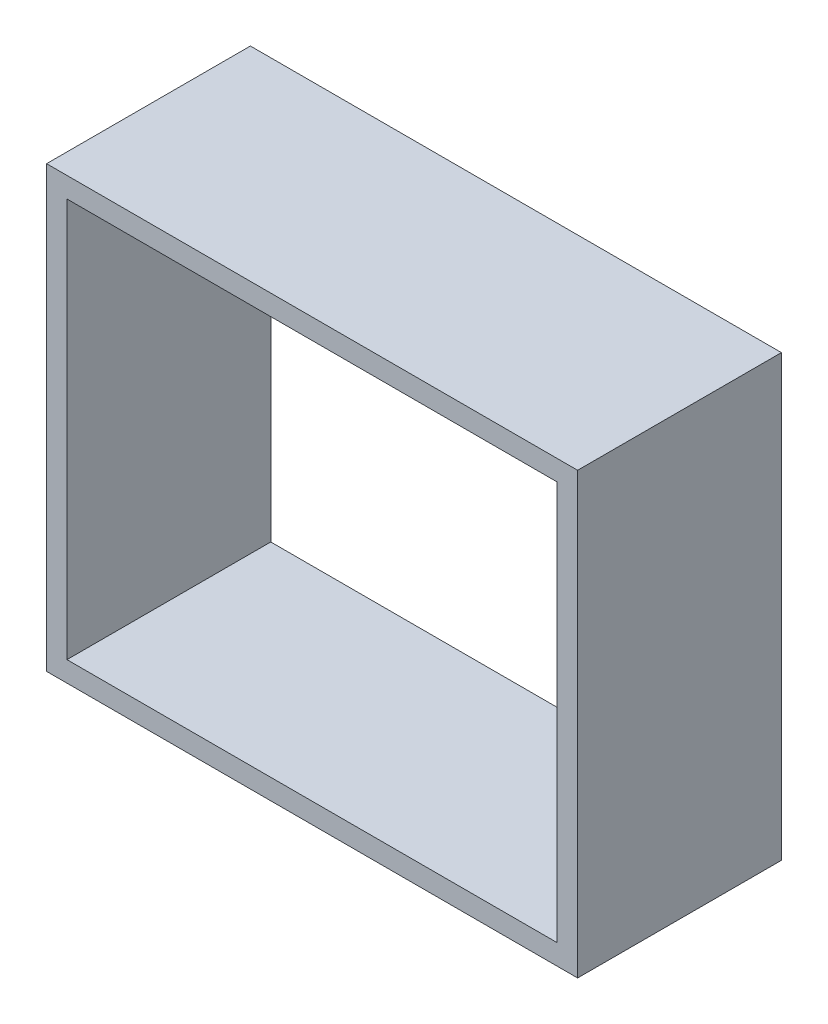
ISO-10303-21;
HEADER;
FILE_DESCRIPTION(('STEP AP214'),'2;1');
FILE_NAME('part.step','',(''),(''),'','','');
FILE_SCHEMA(('AUTOMOTIVE_DESIGN { 1 0 10303 214 1 1 1 1 }'));
ENDSEC;
DATA;
#1=APPLICATION_CONTEXT('core data for automotive mechanical design processes');
#2=APPLICATION_PROTOCOL_DEFINITION('international standard','automotive_design',2000,#1);
#3=PRODUCT_CONTEXT('',#1,'mechanical');
#4=PRODUCT('Part','Part','',(#3));
#5=PRODUCT_RELATED_PRODUCT_CATEGORY('part','',(#4));
#6=PRODUCT_DEFINITION_FORMATION('','',#4);
#7=PRODUCT_DEFINITION_CONTEXT('part definition',#1,'design');
#8=PRODUCT_DEFINITION('design','',#6,#7);
#9=PRODUCT_DEFINITION_SHAPE('','',#8);
#10=(LENGTH_UNIT() NAMED_UNIT(*) SI_UNIT(.MILLI.,.METRE.));
#11=(NAMED_UNIT(*) PLANE_ANGLE_UNIT() SI_UNIT($,.RADIAN.));
#12=(NAMED_UNIT(*) SI_UNIT($,.STERADIAN.) SOLID_ANGLE_UNIT());
#13=UNCERTAINTY_MEASURE_WITH_UNIT(LENGTH_MEASURE(1.E-05),#10,'distance_accuracy_value','');
#14=(GEOMETRIC_REPRESENTATION_CONTEXT(3) GLOBAL_UNCERTAINTY_ASSIGNED_CONTEXT((#13)) GLOBAL_UNIT_ASSIGNED_CONTEXT((#10,
#11,#12)) REPRESENTATION_CONTEXT('',''));
#15=CARTESIAN_POINT('',(0.,0.,0.));
#16=DIRECTION('',(0.,0.,1.));
#17=DIRECTION('',(1.,0.,0.));
#18=AXIS2_PLACEMENT_3D('',#15,#16,#17);
#19=CARTESIAN_POINT('',(0.,0.,50.));
#20=DIRECTION('',(0.,0.,1.));
#21=DIRECTION('',(1.,0.,0.));
#22=AXIS2_PLACEMENT_3D('',#19,#20,#21);
#23=PLANE('',#22);
#24=DIRECTION('',(0.,-1.,0.));
#25=VECTOR('',#24,1.);
#26=CARTESIAN_POINT('',(-32.7272727272732,70.5301378498123,50.));
#27=LINE('',#26,#25);
#28=CARTESIAN_POINT('',(-32.7272727272732,70.5301378498123,50.));
#29=VERTEX_POINT('',#28);
#30=CARTESIAN_POINT('',(-32.7272727272731,-37.3484848484853,50.));
#31=VERTEX_POINT('',#30);
#32=EDGE_CURVE('E134',#29,#31,#27,.T.);
#33=ORIENTED_EDGE('',*,*,#32,.T.);
#34=DIRECTION('',(1.,0.,0.));
#35=VECTOR('',#34,1.);
#36=CARTESIAN_POINT('',(-32.7272727272731,-37.3484848484853,50.));
#37=LINE('',#36,#35);
#38=CARTESIAN_POINT('',(97.5564292307329,-37.3484848484853,50.));
#39=VERTEX_POINT('',#38);
#40=EDGE_CURVE('E137',#31,#39,#37,.T.);
#41=ORIENTED_EDGE('',*,*,#40,.T.);
#42=DIRECTION('',(0.,1.,0.));
#43=VECTOR('',#42,1.);
#44=CARTESIAN_POINT('',(97.5564292307329,70.5301378498123,50.));
#45=LINE('',#44,#43);
#46=CARTESIAN_POINT('',(97.5564292307329,70.5301378498123,50.));
#47=VERTEX_POINT('',#46);
#48=EDGE_CURVE('E140',#39,#47,#45,.T.);
#49=ORIENTED_EDGE('',*,*,#48,.T.);
#50=DIRECTION('',(-1.,0.,0.));
#51=VECTOR('',#50,1.);
#52=CARTESIAN_POINT('',(-32.7272727272732,70.5301378498123,50.));
#53=LINE('',#52,#51);
#54=EDGE_CURVE('E142',#47,#29,#53,.T.);
#55=ORIENTED_EDGE('',*,*,#54,.T.);
#56=EDGE_LOOP('',(#33,#41,#49,#55));
#57=FACE_BOUND('',#56,.T.);
#58=DIRECTION('',(1.,0.,0.));
#59=VECTOR('',#58,1.);
#60=CARTESIAN_POINT('',(-27.7272727272731,-32.3484848484852,50.));
#61=LINE('',#60,#59);
#62=CARTESIAN_POINT('',(-27.7272727272731,-32.3484848484852,50.));
#63=VERTEX_POINT('',#62);
#64=CARTESIAN_POINT('',(92.5564292307329,-32.3484848484852,50.));
#65=VERTEX_POINT('',#64);
#66=EDGE_CURVE('E106',#63,#65,#61,.T.);
#67=ORIENTED_EDGE('',*,*,#66,.F.);
#68=DIRECTION('',(0.,-1.,0.));
#69=VECTOR('',#68,1.);
#70=CARTESIAN_POINT('',(-27.7272727272731,65.5301378498123,50.));
#71=LINE('',#70,#69);
#72=CARTESIAN_POINT('',(-27.7272727272731,65.5301378498123,50.));
#73=VERTEX_POINT('',#72);
#74=EDGE_CURVE('E98',#73,#63,#71,.T.);
#75=ORIENTED_EDGE('',*,*,#74,.F.);
#76=DIRECTION('',(-1.,0.,0.));
#77=VECTOR('',#76,1.);
#78=CARTESIAN_POINT('',(-27.7272727272731,65.5301378498123,50.));
#79=LINE('',#78,#77);
#80=CARTESIAN_POINT('',(92.5564292307328,65.5301378498123,50.));
#81=VERTEX_POINT('',#80);
#82=EDGE_CURVE('E120',#81,#73,#79,.T.);
#83=ORIENTED_EDGE('',*,*,#82,.F.);
#84=DIRECTION('',(0.,1.,0.));
#85=VECTOR('',#84,1.);
#86=CARTESIAN_POINT('',(92.5564292307328,65.5301378498123,50.));
#87=LINE('',#86,#85);
#88=EDGE_CURVE('E118',#65,#81,#87,.T.);
#89=ORIENTED_EDGE('',*,*,#88,.F.);
#90=EDGE_LOOP('',(#67,#75,#83,#89));
#91=FACE_BOUND('',#90,.T.);
#92=ADVANCED_FACE('F33',(#57,#91),#23,.T.);
#93=CARTESIAN_POINT('',(0.,0.,0.));
#94=DIRECTION('',(0.,0.,1.));
#95=DIRECTION('',(1.,0.,0.));
#96=AXIS2_PLACEMENT_3D('',#93,#94,#95);
#97=PLANE('',#96);
#98=DIRECTION('',(0.,-1.,0.));
#99=VECTOR('',#98,1.);
#100=CARTESIAN_POINT('',(-32.7272727272732,70.5301378498123,0.));
#101=LINE('',#100,#99);
#102=CARTESIAN_POINT('',(-32.7272727272732,70.5301378498123,0.));
#103=VERTEX_POINT('',#102);
#104=CARTESIAN_POINT('',(-32.7272727272731,-37.3484848484853,0.));
#105=VERTEX_POINT('',#104);
#106=EDGE_CURVE('E114',#103,#105,#101,.T.);
#107=ORIENTED_EDGE('',*,*,#106,.F.);
#108=DIRECTION('',(-1.,0.,0.));
#109=VECTOR('',#108,1.);
#110=CARTESIAN_POINT('',(-32.7272727272732,70.5301378498123,0.));
#111=LINE('',#110,#109);
#112=CARTESIAN_POINT('',(97.5564292307329,70.5301378498123,0.));
#113=VERTEX_POINT('',#112);
#114=EDGE_CURVE('E138',#113,#103,#111,.T.);
#115=ORIENTED_EDGE('',*,*,#114,.F.);
#116=DIRECTION('',(0.,1.,0.));
#117=VECTOR('',#116,1.);
#118=CARTESIAN_POINT('',(97.5564292307329,70.5301378498123,0.));
#119=LINE('',#118,#117);
#120=CARTESIAN_POINT('',(97.5564292307329,-37.3484848484853,0.));
#121=VERTEX_POINT('',#120);
#122=EDGE_CURVE('E149',#121,#113,#119,.T.);
#123=ORIENTED_EDGE('',*,*,#122,.F.);
#124=DIRECTION('',(1.,0.,0.));
#125=VECTOR('',#124,1.);
#126=CARTESIAN_POINT('',(-32.7272727272731,-37.3484848484853,0.));
#127=LINE('',#126,#125);
#128=EDGE_CURVE('E147',#105,#121,#127,.T.);
#129=ORIENTED_EDGE('',*,*,#128,.F.);
#130=EDGE_LOOP('',(#107,#115,#123,#129));
#131=FACE_BOUND('',#130,.T.);
#132=DIRECTION('',(0.,-1.,0.));
#133=VECTOR('',#132,1.);
#134=CARTESIAN_POINT('',(-27.7272727272731,65.5301378498123,0.));
#135=LINE('',#134,#133);
#136=CARTESIAN_POINT('',(-27.7272727272731,65.5301378498123,0.));
#137=VERTEX_POINT('',#136);
#138=CARTESIAN_POINT('',(-27.7272727272731,-32.3484848484852,0.));
#139=VERTEX_POINT('',#138);
#140=EDGE_CURVE('E56',#137,#139,#135,.T.);
#141=ORIENTED_EDGE('',*,*,#140,.T.);
#142=DIRECTION('',(1.,0.,0.));
#143=VECTOR('',#142,1.);
#144=CARTESIAN_POINT('',(-27.7272727272731,-32.3484848484852,0.));
#145=LINE('',#144,#143);
#146=CARTESIAN_POINT('',(92.5564292307329,-32.3484848484852,0.));
#147=VERTEX_POINT('',#146);
#148=EDGE_CURVE('E113',#139,#147,#145,.T.);
#149=ORIENTED_EDGE('',*,*,#148,.T.);
#150=DIRECTION('',(0.,1.,0.));
#151=VECTOR('',#150,1.);
#152=CARTESIAN_POINT('',(92.5564292307328,65.5301378498123,0.));
#153=LINE('',#152,#151);
#154=CARTESIAN_POINT('',(92.5564292307328,65.5301378498123,0.));
#155=VERTEX_POINT('',#154);
#156=EDGE_CURVE('E126',#147,#155,#153,.T.);
#157=ORIENTED_EDGE('',*,*,#156,.T.);
#158=DIRECTION('',(-1.,0.,0.));
#159=VECTOR('',#158,1.);
#160=CARTESIAN_POINT('',(-27.7272727272731,65.5301378498123,0.));
#161=LINE('',#160,#159);
#162=EDGE_CURVE('E107',#155,#137,#161,.T.);
#163=ORIENTED_EDGE('',*,*,#162,.T.);
#164=EDGE_LOOP('',(#141,#149,#157,#163));
#165=FACE_BOUND('',#164,.T.);
#166=ADVANCED_FACE('F167',(#131,#165),#97,.F.);
#167=CARTESIAN_POINT('',(-32.7272727272732,70.5301378498123,50.));
#168=DIRECTION('',(1.,0.,0.));
#169=DIRECTION('',(0.,1.,0.));
#170=AXIS2_PLACEMENT_3D('',#167,#168,#169);
#171=PLANE('',#170);
#172=ORIENTED_EDGE('',*,*,#106,.T.);
#173=DIRECTION('',(0.,0.,-1.));
#174=VECTOR('',#173,1.);
#175=CARTESIAN_POINT('',(-32.7272727272731,-37.3484848484853,50.));
#176=LINE('',#175,#174);
#177=EDGE_CURVE('E11',#31,#105,#176,.T.);
#178=ORIENTED_EDGE('',*,*,#177,.F.);
#179=ORIENTED_EDGE('',*,*,#32,.F.);
#180=DIRECTION('',(0.,0.,-1.));
#181=VECTOR('',#180,1.);
#182=CARTESIAN_POINT('',(-32.7272727272732,70.5301378498123,50.));
#183=LINE('',#182,#181);
#184=EDGE_CURVE('E144',#29,#103,#183,.T.);
#185=ORIENTED_EDGE('',*,*,#184,.T.);
#186=EDGE_LOOP('',(#172,#178,#179,#185));
#187=FACE_BOUND('',#186,.T.);
#188=ADVANCED_FACE('F35',(#187),#171,.F.);
#189=CARTESIAN_POINT('',(-32.7272727272731,-37.3484848484853,50.));
#190=DIRECTION('',(0.,1.,0.));
#191=DIRECTION('',(-1.,0.,0.));
#192=AXIS2_PLACEMENT_3D('',#189,#190,#191);
#193=PLANE('',#192);
#194=ORIENTED_EDGE('',*,*,#128,.T.);
#195=DIRECTION('',(0.,0.,-1.));
#196=VECTOR('',#195,1.);
#197=CARTESIAN_POINT('',(97.5564292307329,-37.3484848484853,50.));
#198=LINE('',#197,#196);
#199=EDGE_CURVE('E41',#39,#121,#198,.T.);
#200=ORIENTED_EDGE('',*,*,#199,.F.);
#201=ORIENTED_EDGE('',*,*,#40,.F.);
#202=ORIENTED_EDGE('',*,*,#177,.T.);
#203=EDGE_LOOP('',(#194,#200,#201,#202));
#204=FACE_BOUND('',#203,.T.);
#205=ADVANCED_FACE('F177',(#204),#193,.F.);
#206=CARTESIAN_POINT('',(97.5564292307329,70.5301378498123,50.));
#207=DIRECTION('',(-1.,0.,0.));
#208=DIRECTION('',(0.,0.,1.));
#209=AXIS2_PLACEMENT_3D('',#206,#207,#208);
#210=PLANE('',#209);
#211=ORIENTED_EDGE('',*,*,#122,.T.);
#212=DIRECTION('',(0.,0.,-1.));
#213=VECTOR('',#212,1.);
#214=CARTESIAN_POINT('',(97.5564292307329,70.5301378498123,50.));
#215=LINE('',#214,#213);
#216=EDGE_CURVE('E154',#47,#113,#215,.T.);
#217=ORIENTED_EDGE('',*,*,#216,.F.);
#218=ORIENTED_EDGE('',*,*,#48,.F.);
#219=ORIENTED_EDGE('',*,*,#199,.T.);
#220=EDGE_LOOP('',(#211,#217,#218,#219));
#221=FACE_BOUND('',#220,.T.);
#222=ADVANCED_FACE('F161',(#221),#210,.F.);
#223=CARTESIAN_POINT('',(-32.7272727272732,70.5301378498123,50.));
#224=DIRECTION('',(0.,-1.,0.));
#225=DIRECTION('',(1.,0.,0.));
#226=AXIS2_PLACEMENT_3D('',#223,#224,#225);
#227=PLANE('',#226);
#228=ORIENTED_EDGE('',*,*,#114,.T.);
#229=ORIENTED_EDGE('',*,*,#184,.F.);
#230=ORIENTED_EDGE('',*,*,#54,.F.);
#231=ORIENTED_EDGE('',*,*,#216,.T.);
#232=EDGE_LOOP('',(#228,#229,#230,#231));
#233=FACE_BOUND('',#232,.T.);
#234=ADVANCED_FACE('F171',(#233),#227,.F.);
#235=CARTESIAN_POINT('',(-27.7272727272731,65.5301378498123,50.));
#236=DIRECTION('',(1.,0.,0.));
#237=DIRECTION('',(0.,1.,0.));
#238=AXIS2_PLACEMENT_3D('',#235,#236,#237);
#239=PLANE('',#238);
#240=ORIENTED_EDGE('',*,*,#140,.F.);
#241=DIRECTION('',(0.,0.,-1.));
#242=VECTOR('',#241,1.);
#243=CARTESIAN_POINT('',(-27.7272727272731,65.5301378498123,50.));
#244=LINE('',#243,#242);
#245=EDGE_CURVE('E102',#73,#137,#244,.T.);
#246=ORIENTED_EDGE('',*,*,#245,.F.);
#247=ORIENTED_EDGE('',*,*,#74,.T.);
#248=DIRECTION('',(0.,0.,-1.));
#249=VECTOR('',#248,1.);
#250=CARTESIAN_POINT('',(-27.7272727272731,-32.3484848484852,50.));
#251=LINE('',#250,#249);
#252=EDGE_CURVE('E101',#63,#139,#251,.T.);
#253=ORIENTED_EDGE('',*,*,#252,.T.);
#254=EDGE_LOOP('',(#240,#246,#247,#253));
#255=FACE_BOUND('',#254,.T.);
#256=ADVANCED_FACE('F100',(#255),#239,.T.);
#257=CARTESIAN_POINT('',(-27.7272727272731,-32.3484848484852,50.));
#258=DIRECTION('',(0.,1.,0.));
#259=DIRECTION('',(-1.,0.,0.));
#260=AXIS2_PLACEMENT_3D('',#257,#258,#259);
#261=PLANE('',#260);
#262=ORIENTED_EDGE('',*,*,#148,.F.);
#263=ORIENTED_EDGE('',*,*,#252,.F.);
#264=ORIENTED_EDGE('',*,*,#66,.T.);
#265=DIRECTION('',(0.,0.,-1.));
#266=VECTOR('',#265,1.);
#267=CARTESIAN_POINT('',(92.5564292307329,-32.3484848484852,50.));
#268=LINE('',#267,#266);
#269=EDGE_CURVE('E115',#65,#147,#268,.T.);
#270=ORIENTED_EDGE('',*,*,#269,.T.);
#271=EDGE_LOOP('',(#262,#263,#264,#270));
#272=FACE_BOUND('',#271,.T.);
#273=ADVANCED_FACE('F110',(#272),#261,.T.);
#274=CARTESIAN_POINT('',(92.5564292307328,65.5301378498123,50.));
#275=DIRECTION('',(-1.,0.,0.));
#276=DIRECTION('',(0.,-1.,0.));
#277=AXIS2_PLACEMENT_3D('',#274,#275,#276);
#278=PLANE('',#277);
#279=ORIENTED_EDGE('',*,*,#156,.F.);
#280=ORIENTED_EDGE('',*,*,#269,.F.);
#281=ORIENTED_EDGE('',*,*,#88,.T.);
#282=DIRECTION('',(0.,0.,-1.));
#283=VECTOR('',#282,1.);
#284=CARTESIAN_POINT('',(92.5564292307328,65.5301378498123,50.));
#285=LINE('',#284,#283);
#286=EDGE_CURVE('E48',#81,#155,#285,.T.);
#287=ORIENTED_EDGE('',*,*,#286,.T.);
#288=EDGE_LOOP('',(#279,#280,#281,#287));
#289=FACE_BOUND('',#288,.T.);
#290=ADVANCED_FACE('F200',(#289),#278,.T.);
#291=CARTESIAN_POINT('',(-27.7272727272731,65.5301378498123,50.));
#292=DIRECTION('',(0.,-1.,0.));
#293=DIRECTION('',(1.,0.,0.));
#294=AXIS2_PLACEMENT_3D('',#291,#292,#293);
#295=PLANE('',#294);
#296=ORIENTED_EDGE('',*,*,#162,.F.);
#297=ORIENTED_EDGE('',*,*,#286,.F.);
#298=ORIENTED_EDGE('',*,*,#82,.T.);
#299=ORIENTED_EDGE('',*,*,#245,.T.);
#300=EDGE_LOOP('',(#296,#297,#298,#299));
#301=FACE_BOUND('',#300,.T.);
#302=ADVANCED_FACE('F204',(#301),#295,.T.);
#303=CLOSED_SHELL('',(#92,#166,#188,#205,#222,#234,#256,#273,#290,#302));
#304=MANIFOLD_SOLID_BREP('B2',#303);
#305=ADVANCED_BREP_SHAPE_REPRESENTATION('',(#18,#304),#14);
#306=SHAPE_DEFINITION_REPRESENTATION(#9,#305);
ENDSEC;
END-ISO-10303-21;
